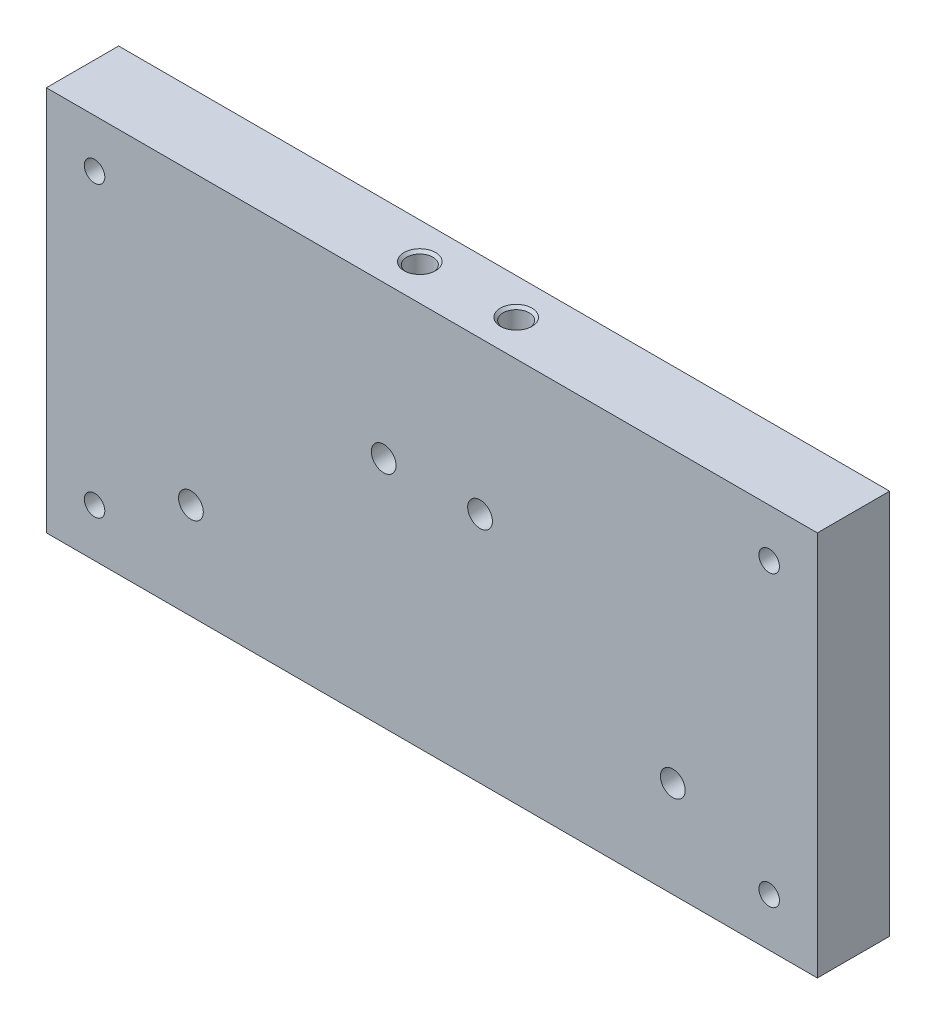
ISO-10303-21;
HEADER;
FILE_DESCRIPTION(('STEP AP214'),'2;1');
FILE_NAME('part.step','',(''),(''),'','','');
FILE_SCHEMA(('AUTOMOTIVE_DESIGN { 1 0 10303 214 1 1 1 1 }'));
ENDSEC;
DATA;
#1=APPLICATION_CONTEXT('core data for automotive mechanical design processes');
#2=APPLICATION_PROTOCOL_DEFINITION('international standard','automotive_design',2000,#1);
#3=PRODUCT_CONTEXT('',#1,'mechanical');
#4=PRODUCT('Part','Part','',(#3));
#5=PRODUCT_RELATED_PRODUCT_CATEGORY('part','',(#4));
#6=PRODUCT_DEFINITION_FORMATION('','',#4);
#7=PRODUCT_DEFINITION_CONTEXT('part definition',#1,'design');
#8=PRODUCT_DEFINITION('design','',#6,#7);
#9=PRODUCT_DEFINITION_SHAPE('','',#8);
#10=(LENGTH_UNIT() NAMED_UNIT(*) SI_UNIT(.MILLI.,.METRE.));
#11=(NAMED_UNIT(*) PLANE_ANGLE_UNIT() SI_UNIT($,.RADIAN.));
#12=(NAMED_UNIT(*) SI_UNIT($,.STERADIAN.) SOLID_ANGLE_UNIT());
#13=UNCERTAINTY_MEASURE_WITH_UNIT(LENGTH_MEASURE(1.E-05),#10,'distance_accuracy_value','');
#14=(GEOMETRIC_REPRESENTATION_CONTEXT(3) GLOBAL_UNCERTAINTY_ASSIGNED_CONTEXT((#13)) GLOBAL_UNIT_ASSIGNED_CONTEXT((#10,
#11,#12)) REPRESENTATION_CONTEXT('',''));
#15=CARTESIAN_POINT('',(0.,0.,0.));
#16=DIRECTION('',(0.,0.,1.));
#17=DIRECTION('',(1.,0.,0.));
#18=AXIS2_PLACEMENT_3D('',#15,#16,#17);
#19=CARTESIAN_POINT('',(-44.45,31.75,4.7625));
#20=DIRECTION('',(0.,1.,0.));
#21=DIRECTION('',(0.,0.,1.));
#22=AXIS2_PLACEMENT_3D('',#19,#20,#21);
#23=CONICAL_SURFACE('',#22,1.7272,1.02974425867665);
#24=CARTESIAN_POINT('',(-44.45,31.75,4.7625));
#25=DIRECTION('',(0.,1.,0.));
#26=DIRECTION('',(0.,0.,1.));
#27=AXIS2_PLACEMENT_3D('',#24,#25,#26);
#28=CIRCLE('',#27,1.7272);
#29=CARTESIAN_POINT('',(-45.7094516868955,31.75,3.58055190961019));
#30=VERTEX_POINT('',#29);
#31=CARTESIAN_POINT('',(-45.7094516868955,31.75,5.9444480903898));
#32=VERTEX_POINT('',#31);
#33=EDGE_CURVE('E118',#30,#32,#28,.T.);
#34=ORIENTED_EDGE('',*,*,#33,.T.);
#35=CARTESIAN_POINT('',(-45.616011579744,31.8539806461184,6.26295923378334));
#36=CARTESIAN_POINT('',(-45.6424570450371,31.8269669654984,6.18537432550865));
#37=CARTESIAN_POINT('',(-45.6663991134377,31.8006455714118,6.10669294519788));
#38=CARTESIAN_POINT('',(-45.7096233368764,31.7503246925266,5.94723039181544));
#39=CARTESIAN_POINT('',(-45.7289002407733,31.7263278422969,5.86644696485549));
#40=CARTESIAN_POINT('',(-45.7630504777691,31.6817010112174,5.70320454241134));
#41=CARTESIAN_POINT('',(-45.7779321701815,31.6610646729566,5.62074905059366));
#42=CARTESIAN_POINT('',(-45.8034684912397,31.6242720820129,5.45420867147322));
#43=CARTESIAN_POINT('',(-45.8141245000215,31.6081143671023,5.37012432559106));
#44=CARTESIAN_POINT('',(-45.830833970879,31.5821284895861,5.20474289893614));
#45=CARTESIAN_POINT('',(-45.8370860561425,31.57203072987,5.12350912484162));
#46=CARTESIAN_POINT('',(-45.8457783440632,31.5578501000965,4.96031459335005));
#47=CARTESIAN_POINT('',(-45.8482192357415,31.5537661428187,4.87835397005438));
#48=CARTESIAN_POINT('',(-45.8492718385232,31.5520152667129,4.7143441845942));
#49=CARTESIAN_POINT('',(-45.8478838775211,31.5543477983909,4.63229503061276));
#50=CARTESIAN_POINT('',(-45.8412910646571,31.565193063211,4.46876263607397));
#51=CARTESIAN_POINT('',(-45.836085643314,31.5737067184387,4.38727948178229));
#52=CARTESIAN_POINT('',(-45.8210386646976,31.5974805639097,4.21578962104832));
#53=CARTESIAN_POINT('',(-45.8107196394607,31.613422309852,4.12592083902801));
#54=CARTESIAN_POINT('',(-45.7853132267048,31.6506522389168,3.94796061106254));
#55=CARTESIAN_POINT('',(-45.7702230996727,31.6719434922208,3.85987021724002));
#56=CARTESIAN_POINT('',(-45.7350628735687,31.7185382482151,3.68540089927863));
#57=CARTESIAN_POINT('',(-45.7149740724879,31.7438566868548,3.59902974880056));
#58=CARTESIAN_POINT('',(-45.6809023810317,31.7838495034158,3.47125218362565));
#59=CARTESIAN_POINT('',(-45.6688988619049,31.7975056727167,3.428986189022));
#60=CARTESIAN_POINT('',(-45.6435092646849,31.8253650284051,3.34505547825473));
#61=CARTESIAN_POINT('',(-45.6301232224234,31.8395682006095,3.30339074653975));
#62=CARTESIAN_POINT('',(-45.616011579744,31.8539806461184,3.26204076621666));
#63=B_SPLINE_CURVE_WITH_KNOTS('',3,(#35,#36,#37,#38,#39,#40,#41,#42,#43,#44,#45,#46,#47,#48,#49,
#50,#51,#52,#53,#54,#55,#56,#57,#58,#59,#60,#61,#62),.UNSPECIFIED.,.F.,.F.,(4,2,2,2,2,2,2,2,2,2,
2,2,2,4),(0.,0.258873179804806,0.518036407701557,0.776703507519732,1.03528605525533,
1.28129362561106,1.52725671540037,1.77319874210599,2.01917746541702,2.29439014219718,
2.56976113087808,2.84617830386505,2.98418691842694,3.12219195704241),.UNSPECIFIED.);
#64=EDGE_CURVE('E11',#32,#30,#63,.T.);
#65=ORIENTED_EDGE('',*,*,#64,.T.);
#66=EDGE_LOOP('',(#34,#65));
#67=FACE_BOUND('',#66,.T.);
#68=ADVANCED_FACE('F37',(#67),#23,.F.);
#69=CARTESIAN_POINT('',(-57.15,31.75,4.7625));
#70=DIRECTION('',(0.,1.,0.));
#71=DIRECTION('',(0.,0.,1.));
#72=AXIS2_PLACEMENT_3D('',#69,#70,#71);
#73=CONICAL_SURFACE('',#72,1.7272,1.02974425867665);
#74=CARTESIAN_POINT('',(-57.15,31.75,4.7625));
#75=DIRECTION('',(0.,1.,0.));
#76=DIRECTION('',(0.,0.,1.));
#77=AXIS2_PLACEMENT_3D('',#74,#75,#76);
#78=CIRCLE('',#77,1.7272);
#79=CARTESIAN_POINT('',(-58.4094516868955,31.75,3.5805519096102));
#80=VERTEX_POINT('',#79);
#81=CARTESIAN_POINT('',(-58.4094516868955,31.75,5.9444480903898));
#82=VERTEX_POINT('',#81);
#83=EDGE_CURVE('E133',#80,#82,#78,.T.);
#84=ORIENTED_EDGE('',*,*,#83,.T.);
#85=CARTESIAN_POINT('',(-58.316011579744,31.8539806461184,6.26295923378334));
#86=CARTESIAN_POINT('',(-58.3424570450371,31.8269669654984,6.18537432550865));
#87=CARTESIAN_POINT('',(-58.3663991134377,31.8006455714118,6.10669294519788));
#88=CARTESIAN_POINT('',(-58.4096233368764,31.7503246925266,5.94723039181544));
#89=CARTESIAN_POINT('',(-58.4289002407733,31.7263278422969,5.8664469648555));
#90=CARTESIAN_POINT('',(-58.4630504777691,31.6817010112174,5.70320454241135));
#91=CARTESIAN_POINT('',(-58.4779321701815,31.6610646729566,5.62074905059366));
#92=CARTESIAN_POINT('',(-58.5034684912398,31.6242720820129,5.45420867147323));
#93=CARTESIAN_POINT('',(-58.5141245000215,31.6081143671023,5.37012432559106));
#94=CARTESIAN_POINT('',(-58.530833970879,31.5821284895861,5.20474289893614));
#95=CARTESIAN_POINT('',(-58.5370860561425,31.57203072987,5.12350912484162));
#96=CARTESIAN_POINT('',(-58.5457783440632,31.5578501000965,4.96031459335006));
#97=CARTESIAN_POINT('',(-58.5482192357415,31.5537661428187,4.87835397005439));
#98=CARTESIAN_POINT('',(-58.5492718385232,31.5520152667129,4.7143441845942));
#99=CARTESIAN_POINT('',(-58.5478838775211,31.5543477983909,4.63229503061276));
#100=CARTESIAN_POINT('',(-58.5412910646571,31.565193063211,4.46876263607397));
#101=CARTESIAN_POINT('',(-58.536085643314,31.5737067184387,4.38727948178229));
#102=CARTESIAN_POINT('',(-58.5210386646976,31.5974805639097,4.21578962104832));
#103=CARTESIAN_POINT('',(-58.5107196394607,31.613422309852,4.12592083902801));
#104=CARTESIAN_POINT('',(-58.4853132267048,31.6506522389168,3.94796061106254));
#105=CARTESIAN_POINT('',(-58.4702230996727,31.6719434922208,3.85987021724003));
#106=CARTESIAN_POINT('',(-58.4350628735687,31.7185382482151,3.68540089927863));
#107=CARTESIAN_POINT('',(-58.4149740724879,31.7438566868548,3.59902974880057));
#108=CARTESIAN_POINT('',(-58.3809023810317,31.7838495034158,3.47125218362565));
#109=CARTESIAN_POINT('',(-58.3688988619049,31.7975056727167,3.428986189022));
#110=CARTESIAN_POINT('',(-58.3435092646849,31.8253650284051,3.34505547825474));
#111=CARTESIAN_POINT('',(-58.3301232224234,31.8395682006095,3.30339074653975));
#112=CARTESIAN_POINT('',(-58.316011579744,31.8539806461184,3.26204076621666));
#113=B_SPLINE_CURVE_WITH_KNOTS('',3,(#85,#86,#87,#88,#89,#90,#91,#92,#93,#94,#95,#96,#97,#98,
#99,#100,#101,#102,#103,#104,#105,#106,#107,#108,#109,#110,#111,#112),.UNSPECIFIED.,.F.,.F.,(4,
2,2,2,2,2,2,2,2,2,2,2,2,4),(0.,0.258873179804806,0.518036407701554,0.776703507519731,
1.03528605525533,1.28129362561106,1.52725671540037,1.77319874210599,2.01917746541702,
2.29439014219718,2.56976113087808,2.84617830386505,2.98418691842694,3.12219195704241),.UNSPECIFIED.);
#114=EDGE_CURVE('E111',#82,#80,#113,.T.);
#115=ORIENTED_EDGE('',*,*,#114,.T.);
#116=EDGE_LOOP('',(#84,#115));
#117=FACE_BOUND('',#116,.T.);
#118=ADVANCED_FACE('F271',(#117),#73,.F.);
#119=CARTESIAN_POINT('',(0.,0.,9.525));
#120=DIRECTION('',(-1.,0.,0.));
#121=DIRECTION('',(0.,0.,1.));
#122=AXIS2_PLACEMENT_3D('',#119,#120,#121);
#123=PLANE('',#122);
#124=DIRECTION('',(0.,1.,0.));
#125=VECTOR('',#124,1.);
#126=CARTESIAN_POINT('',(0.,0.,0.));
#127=LINE('',#126,#125);
#128=CARTESIAN_POINT('',(0.,0.,0.));
#129=VERTEX_POINT('',#128);
#130=CARTESIAN_POINT('',(0.,50.8,0.));
#131=VERTEX_POINT('',#130);
#132=EDGE_CURVE('E137',#129,#131,#127,.T.);
#133=ORIENTED_EDGE('',*,*,#132,.T.);
#134=DIRECTION('',(0.,0.,-1.));
#135=VECTOR('',#134,1.);
#136=CARTESIAN_POINT('',(0.,50.8,9.525));
#137=LINE('',#136,#135);
#138=CARTESIAN_POINT('',(0.,50.8,9.525));
#139=VERTEX_POINT('',#138);
#140=EDGE_CURVE('E164',#139,#131,#137,.T.);
#141=ORIENTED_EDGE('',*,*,#140,.F.);
#142=DIRECTION('',(0.,1.,0.));
#143=VECTOR('',#142,1.);
#144=CARTESIAN_POINT('',(0.,0.,9.525));
#145=LINE('',#144,#143);
#146=CARTESIAN_POINT('',(0.,0.,9.525));
#147=VERTEX_POINT('',#146);
#148=EDGE_CURVE('E138',#147,#139,#145,.T.);
#149=ORIENTED_EDGE('',*,*,#148,.F.);
#150=DIRECTION('',(0.,0.,-1.));
#151=VECTOR('',#150,1.);
#152=CARTESIAN_POINT('',(0.,0.,9.525));
#153=LINE('',#152,#151);
#154=EDGE_CURVE('E148',#147,#129,#153,.T.);
#155=ORIENTED_EDGE('',*,*,#154,.T.);
#156=EDGE_LOOP('',(#133,#141,#149,#155));
#157=FACE_BOUND('',#156,.T.);
#158=ADVANCED_FACE('F39',(#157),#123,.F.);
#159=CARTESIAN_POINT('',(0.,50.8,9.525));
#160=DIRECTION('',(0.,-1.,0.));
#161=DIRECTION('',(1.,0.,0.));
#162=AXIS2_PLACEMENT_3D('',#159,#160,#161);
#163=PLANE('',#162);
#164=CARTESIAN_POINT('',(-44.45,50.8,4.7625));
#165=DIRECTION('',(0.,1.,0.));
#166=DIRECTION('',(0.,0.,1.));
#167=AXIS2_PLACEMENT_3D('',#164,#165,#166);
#168=CIRCLE('',#167,2.0828);
#169=CARTESIAN_POINT('',(-44.45,50.8,6.8453));
#170=VERTEX_POINT('',#169);
#171=EDGE_CURVE('E291',#170,#170,#168,.T.);
#172=ORIENTED_EDGE('',*,*,#171,.F.);
#173=EDGE_LOOP('',(#172));
#174=FACE_BOUND('',#173,.T.);
#175=CARTESIAN_POINT('',(-57.15,50.8,4.7625));
#176=DIRECTION('',(0.,1.,0.));
#177=DIRECTION('',(0.,0.,1.));
#178=AXIS2_PLACEMENT_3D('',#175,#176,#177);
#179=CIRCLE('',#178,2.0828);
#180=CARTESIAN_POINT('',(-57.15,50.8,6.8453));
#181=VERTEX_POINT('',#180);
#182=EDGE_CURVE('E122',#181,#181,#179,.T.);
#183=ORIENTED_EDGE('',*,*,#182,.F.);
#184=EDGE_LOOP('',(#183));
#185=FACE_BOUND('',#184,.T.);
#186=DIRECTION('',(-1.,0.,0.));
#187=VECTOR('',#186,1.);
#188=CARTESIAN_POINT('',(0.,50.8,0.));
#189=LINE('',#188,#187);
#190=CARTESIAN_POINT('',(-101.6,50.8,0.));
#191=VERTEX_POINT('',#190);
#192=EDGE_CURVE('E151',#131,#191,#189,.T.);
#193=ORIENTED_EDGE('',*,*,#192,.T.);
#194=DIRECTION('',(0.,0.,-1.));
#195=VECTOR('',#194,1.);
#196=CARTESIAN_POINT('',(-101.6,50.8,9.525));
#197=LINE('',#196,#195);
#198=CARTESIAN_POINT('',(-101.6,50.8,9.525));
#199=VERTEX_POINT('',#198);
#200=EDGE_CURVE('E161',#199,#191,#197,.T.);
#201=ORIENTED_EDGE('',*,*,#200,.F.);
#202=DIRECTION('',(-1.,0.,0.));
#203=VECTOR('',#202,1.);
#204=CARTESIAN_POINT('',(0.,50.8,9.525));
#205=LINE('',#204,#203);
#206=EDGE_CURVE('E141',#139,#199,#205,.T.);
#207=ORIENTED_EDGE('',*,*,#206,.F.);
#208=ORIENTED_EDGE('',*,*,#140,.T.);
#209=EDGE_LOOP('',(#193,#201,#207,#208));
#210=FACE_BOUND('',#209,.T.);
#211=ADVANCED_FACE('F255',(#174,#185,#210),#163,.F.);
#212=CARTESIAN_POINT('',(-101.6,0.,9.525));
#213=DIRECTION('',(1.,0.,0.));
#214=DIRECTION('',(0.,0.,-1.));
#215=AXIS2_PLACEMENT_3D('',#212,#213,#214);
#216=PLANE('',#215);
#217=DIRECTION('',(0.,-1.,0.));
#218=VECTOR('',#217,1.);
#219=CARTESIAN_POINT('',(-101.6,0.,0.));
#220=LINE('',#219,#218);
#221=CARTESIAN_POINT('',(-101.6,0.,0.));
#222=VERTEX_POINT('',#221);
#223=EDGE_CURVE('E153',#191,#222,#220,.T.);
#224=ORIENTED_EDGE('',*,*,#223,.T.);
#225=DIRECTION('',(0.,0.,-1.));
#226=VECTOR('',#225,1.);
#227=CARTESIAN_POINT('',(-101.6,0.,9.525));
#228=LINE('',#227,#226);
#229=CARTESIAN_POINT('',(-101.6,0.,9.525));
#230=VERTEX_POINT('',#229);
#231=EDGE_CURVE('E158',#230,#222,#228,.T.);
#232=ORIENTED_EDGE('',*,*,#231,.F.);
#233=DIRECTION('',(0.,-1.,0.));
#234=VECTOR('',#233,1.);
#235=CARTESIAN_POINT('',(-101.6,0.,9.525));
#236=LINE('',#235,#234);
#237=EDGE_CURVE('E144',#199,#230,#236,.T.);
#238=ORIENTED_EDGE('',*,*,#237,.F.);
#239=ORIENTED_EDGE('',*,*,#200,.T.);
#240=EDGE_LOOP('',(#224,#232,#238,#239));
#241=FACE_BOUND('',#240,.T.);
#242=ADVANCED_FACE('F260',(#241),#216,.F.);
#243=CARTESIAN_POINT('',(0.,0.,9.525));
#244=DIRECTION('',(0.,1.,0.));
#245=DIRECTION('',(-1.,0.,0.));
#246=AXIS2_PLACEMENT_3D('',#243,#244,#245);
#247=PLANE('',#246);
#248=DIRECTION('',(1.,0.,0.));
#249=VECTOR('',#248,1.);
#250=CARTESIAN_POINT('',(0.,0.,0.));
#251=LINE('',#250,#249);
#252=EDGE_CURVE('E142',#222,#129,#251,.T.);
#253=ORIENTED_EDGE('',*,*,#252,.T.);
#254=ORIENTED_EDGE('',*,*,#154,.F.);
#255=DIRECTION('',(1.,0.,0.));
#256=VECTOR('',#255,1.);
#257=CARTESIAN_POINT('',(0.,0.,9.525));
#258=LINE('',#257,#256);
#259=EDGE_CURVE('E146',#230,#147,#258,.T.);
#260=ORIENTED_EDGE('',*,*,#259,.F.);
#261=ORIENTED_EDGE('',*,*,#231,.T.);
#262=EDGE_LOOP('',(#253,#254,#260,#261));
#263=FACE_BOUND('',#262,.T.);
#264=ADVANCED_FACE('F245',(#263),#247,.F.);
#265=CARTESIAN_POINT('',(0.,0.,9.525));
#266=DIRECTION('',(0.,0.,1.));
#267=DIRECTION('',(1.,0.,0.));
#268=AXIS2_PLACEMENT_3D('',#265,#266,#267);
#269=PLANE('',#268);
#270=CARTESIAN_POINT('',(-82.55,12.7,9.525));
#271=DIRECTION('',(0.,0.,1.));
#272=DIRECTION('',(1.,0.,0.));
#273=AXIS2_PLACEMENT_3D('',#270,#271,#272);
#274=CIRCLE('',#273,1.63194999999999);
#275=CARTESIAN_POINT('',(-80.91805,12.7,9.525));
#276=VERTEX_POINT('',#275);
#277=EDGE_CURVE('E484',#276,#276,#274,.T.);
#278=ORIENTED_EDGE('',*,*,#277,.F.);
#279=EDGE_LOOP('',(#278));
#280=FACE_BOUND('',#279,.T.);
#281=CARTESIAN_POINT('',(-19.05,12.7,9.525));
#282=DIRECTION('',(0.,0.,1.));
#283=DIRECTION('',(1.,0.,0.));
#284=AXIS2_PLACEMENT_3D('',#281,#282,#283);
#285=CIRCLE('',#284,1.63195);
#286=CARTESIAN_POINT('',(-17.41805,12.7,9.525));
#287=VERTEX_POINT('',#286);
#288=EDGE_CURVE('E486',#287,#287,#285,.T.);
#289=ORIENTED_EDGE('',*,*,#288,.F.);
#290=EDGE_LOOP('',(#289));
#291=FACE_BOUND('',#290,.T.);
#292=CARTESIAN_POINT('',(-95.25,6.34999999999999,9.525));
#293=DIRECTION('',(0.,0.,1.));
#294=DIRECTION('',(1.,0.,0.));
#295=AXIS2_PLACEMENT_3D('',#292,#293,#294);
#296=CIRCLE('',#295,1.35254999999998);
#297=CARTESIAN_POINT('',(-93.89745,6.34999999999999,9.525));
#298=VERTEX_POINT('',#297);
#299=EDGE_CURVE('E494',#298,#298,#296,.T.);
#300=ORIENTED_EDGE('',*,*,#299,.F.);
#301=EDGE_LOOP('',(#300));
#302=FACE_BOUND('',#301,.T.);
#303=CARTESIAN_POINT('',(-95.25,44.45,9.525));
#304=DIRECTION('',(0.,0.,1.));
#305=DIRECTION('',(1.,0.,0.));
#306=AXIS2_PLACEMENT_3D('',#303,#304,#305);
#307=CIRCLE('',#306,1.35254999999998);
#308=CARTESIAN_POINT('',(-93.89745,44.45,9.525));
#309=VERTEX_POINT('',#308);
#310=EDGE_CURVE('E500',#309,#309,#307,.T.);
#311=ORIENTED_EDGE('',*,*,#310,.F.);
#312=EDGE_LOOP('',(#311));
#313=FACE_BOUND('',#312,.T.);
#314=CARTESIAN_POINT('',(-6.35,6.35,9.525));
#315=DIRECTION('',(0.,0.,1.));
#316=DIRECTION('',(1.,0.,0.));
#317=AXIS2_PLACEMENT_3D('',#314,#315,#316);
#318=CIRCLE('',#317,1.35254999999999);
#319=CARTESIAN_POINT('',(-4.99745000000001,6.35,9.525));
#320=VERTEX_POINT('',#319);
#321=EDGE_CURVE('E506',#320,#320,#318,.T.);
#322=ORIENTED_EDGE('',*,*,#321,.F.);
#323=EDGE_LOOP('',(#322));
#324=FACE_BOUND('',#323,.T.);
#325=CARTESIAN_POINT('',(-6.35,44.45,9.525));
#326=DIRECTION('',(0.,0.,1.));
#327=DIRECTION('',(1.,0.,0.));
#328=AXIS2_PLACEMENT_3D('',#325,#326,#327);
#329=CIRCLE('',#328,1.35254999999999);
#330=CARTESIAN_POINT('',(-4.99745000000001,44.45,9.525));
#331=VERTEX_POINT('',#330);
#332=EDGE_CURVE('E512',#331,#331,#329,.T.);
#333=ORIENTED_EDGE('',*,*,#332,.F.);
#334=EDGE_LOOP('',(#333));
#335=FACE_BOUND('',#334,.T.);
#336=CARTESIAN_POINT('',(-44.45,30.7121935388156,9.525));
#337=DIRECTION('',(0.,0.,1.));
#338=DIRECTION('',(1.,0.,0.));
#339=AXIS2_PLACEMENT_3D('',#336,#337,#338);
#340=CIRCLE('',#339,1.63195);
#341=CARTESIAN_POINT('',(-42.81805,30.7121935388156,9.525));
#342=VERTEX_POINT('',#341);
#343=EDGE_CURVE('E119',#342,#342,#340,.T.);
#344=ORIENTED_EDGE('',*,*,#343,.F.);
#345=EDGE_LOOP('',(#344));
#346=FACE_BOUND('',#345,.T.);
#347=CARTESIAN_POINT('',(-57.15,30.7121935388156,9.525));
#348=DIRECTION('',(0.,0.,1.));
#349=DIRECTION('',(1.,0.,0.));
#350=AXIS2_PLACEMENT_3D('',#347,#348,#349);
#351=CIRCLE('',#350,1.63195);
#352=CARTESIAN_POINT('',(-55.51805,30.7121935388156,9.525));
#353=VERTEX_POINT('',#352);
#354=EDGE_CURVE('E200',#353,#353,#351,.T.);
#355=ORIENTED_EDGE('',*,*,#354,.F.);
#356=EDGE_LOOP('',(#355));
#357=FACE_BOUND('',#356,.T.);
#358=ORIENTED_EDGE('',*,*,#148,.T.);
#359=ORIENTED_EDGE('',*,*,#206,.T.);
#360=ORIENTED_EDGE('',*,*,#237,.T.);
#361=ORIENTED_EDGE('',*,*,#259,.T.);
#362=EDGE_LOOP('',(#358,#359,#360,#361));
#363=FACE_BOUND('',#362,.T.);
#364=ADVANCED_FACE('F241',(#280,#291,#302,#313,#324,#335,#346,#357,#363),#269,.T.);
#365=CARTESIAN_POINT('',(0.,0.,0.));
#366=DIRECTION('',(0.,0.,1.));
#367=DIRECTION('',(1.,0.,0.));
#368=AXIS2_PLACEMENT_3D('',#365,#366,#367);
#369=PLANE('',#368);
#370=CARTESIAN_POINT('',(-82.55,12.7,0.));
#371=DIRECTION('',(0.,0.,1.));
#372=DIRECTION('',(1.,0.,0.));
#373=AXIS2_PLACEMENT_3D('',#370,#371,#372);
#374=CIRCLE('',#373,1.63194999999999);
#375=CARTESIAN_POINT('',(-80.91805,12.7,0.));
#376=VERTEX_POINT('',#375);
#377=EDGE_CURVE('E481',#376,#376,#374,.T.);
#378=ORIENTED_EDGE('',*,*,#377,.T.);
#379=EDGE_LOOP('',(#378));
#380=FACE_BOUND('',#379,.T.);
#381=CARTESIAN_POINT('',(-19.05,12.7,0.));
#382=DIRECTION('',(0.,0.,1.));
#383=DIRECTION('',(1.,0.,0.));
#384=AXIS2_PLACEMENT_3D('',#381,#382,#383);
#385=CIRCLE('',#384,1.63195);
#386=CARTESIAN_POINT('',(-17.41805,12.7,0.));
#387=VERTEX_POINT('',#386);
#388=EDGE_CURVE('E491',#387,#387,#385,.T.);
#389=ORIENTED_EDGE('',*,*,#388,.T.);
#390=EDGE_LOOP('',(#389));
#391=FACE_BOUND('',#390,.T.);
#392=CARTESIAN_POINT('',(-95.25,6.34999999999999,0.));
#393=DIRECTION('',(0.,0.,1.));
#394=DIRECTION('',(1.,0.,0.));
#395=AXIS2_PLACEMENT_3D('',#392,#393,#394);
#396=CIRCLE('',#395,1.35254999999999);
#397=CARTESIAN_POINT('',(-93.89745,6.34999999999999,0.));
#398=VERTEX_POINT('',#397);
#399=EDGE_CURVE('E497',#398,#398,#396,.T.);
#400=ORIENTED_EDGE('',*,*,#399,.T.);
#401=EDGE_LOOP('',(#400));
#402=FACE_BOUND('',#401,.T.);
#403=CARTESIAN_POINT('',(-95.25,44.45,0.));
#404=DIRECTION('',(0.,0.,1.));
#405=DIRECTION('',(1.,0.,0.));
#406=AXIS2_PLACEMENT_3D('',#403,#404,#405);
#407=CIRCLE('',#406,1.35254999999999);
#408=CARTESIAN_POINT('',(-93.89745,44.45,0.));
#409=VERTEX_POINT('',#408);
#410=EDGE_CURVE('E503',#409,#409,#407,.T.);
#411=ORIENTED_EDGE('',*,*,#410,.T.);
#412=EDGE_LOOP('',(#411));
#413=FACE_BOUND('',#412,.T.);
#414=CARTESIAN_POINT('',(-6.35,6.35,0.));
#415=DIRECTION('',(0.,0.,1.));
#416=DIRECTION('',(1.,0.,0.));
#417=AXIS2_PLACEMENT_3D('',#414,#415,#416);
#418=CIRCLE('',#417,1.35255);
#419=CARTESIAN_POINT('',(-4.99745,6.35,0.));
#420=VERTEX_POINT('',#419);
#421=EDGE_CURVE('E509',#420,#420,#418,.T.);
#422=ORIENTED_EDGE('',*,*,#421,.T.);
#423=EDGE_LOOP('',(#422));
#424=FACE_BOUND('',#423,.T.);
#425=CARTESIAN_POINT('',(-6.35,44.45,0.));
#426=DIRECTION('',(0.,0.,1.));
#427=DIRECTION('',(1.,0.,0.));
#428=AXIS2_PLACEMENT_3D('',#425,#426,#427);
#429=CIRCLE('',#428,1.35255);
#430=CARTESIAN_POINT('',(-4.99745,44.45,0.));
#431=VERTEX_POINT('',#430);
#432=EDGE_CURVE('E515',#431,#431,#429,.T.);
#433=ORIENTED_EDGE('',*,*,#432,.T.);
#434=EDGE_LOOP('',(#433));
#435=FACE_BOUND('',#434,.T.);
#436=CARTESIAN_POINT('',(-44.45,30.7121935388156,0.));
#437=DIRECTION('',(0.,0.,1.));
#438=DIRECTION('',(1.,0.,0.));
#439=AXIS2_PLACEMENT_3D('',#436,#437,#438);
#440=CIRCLE('',#439,1.63195);
#441=CARTESIAN_POINT('',(-42.81805,30.7121935388156,0.));
#442=VERTEX_POINT('',#441);
#443=EDGE_CURVE('E232',#442,#442,#440,.T.);
#444=ORIENTED_EDGE('',*,*,#443,.T.);
#445=EDGE_LOOP('',(#444));
#446=FACE_BOUND('',#445,.T.);
#447=CARTESIAN_POINT('',(-57.15,30.7121935388156,0.));
#448=DIRECTION('',(0.,0.,1.));
#449=DIRECTION('',(1.,0.,0.));
#450=AXIS2_PLACEMENT_3D('',#447,#448,#449);
#451=CIRCLE('',#450,1.63195);
#452=CARTESIAN_POINT('',(-55.51805,30.7121935388156,0.));
#453=VERTEX_POINT('',#452);
#454=EDGE_CURVE('E289',#453,#453,#451,.T.);
#455=ORIENTED_EDGE('',*,*,#454,.T.);
#456=EDGE_LOOP('',(#455));
#457=FACE_BOUND('',#456,.T.);
#458=ORIENTED_EDGE('',*,*,#132,.F.);
#459=ORIENTED_EDGE('',*,*,#252,.F.);
#460=ORIENTED_EDGE('',*,*,#223,.F.);
#461=ORIENTED_EDGE('',*,*,#192,.F.);
#462=EDGE_LOOP('',(#458,#459,#460,#461));
#463=FACE_BOUND('',#462,.T.);
#464=ADVANCED_FACE('F244',(#380,#391,#402,#413,#424,#435,#446,#457,#463),#369,.F.);
#465=CARTESIAN_POINT('',(-55.8905483131045,31.75,5.94444809038982));
#466=VERTEX_POINT('',#465);
#467=CARTESIAN_POINT('',(-55.8905483131045,31.75,3.58055190961018));
#468=VERTEX_POINT('',#467);
#469=EDGE_CURVE('E134',#466,#468,#78,.T.);
#470=ORIENTED_EDGE('',*,*,#469,.T.);
#471=CARTESIAN_POINT('',(-55.9839884202561,31.8539806461184,3.26204076621665));
#472=CARTESIAN_POINT('',(-55.957542954963,31.8269669654984,3.33962567449134));
#473=CARTESIAN_POINT('',(-55.9336008865623,31.8006455714118,3.41830705480211));
#474=CARTESIAN_POINT('',(-55.8903766631236,31.7503246925266,3.57776960818455));
#475=CARTESIAN_POINT('',(-55.8710997592267,31.7263278422969,3.65855303514449));
#476=CARTESIAN_POINT('',(-55.836949522231,31.6817010112174,3.82179545758864));
#477=CARTESIAN_POINT('',(-55.8220678298186,31.6610646729566,3.90425094940633));
#478=CARTESIAN_POINT('',(-55.7965315087603,31.6242720820129,4.07079132852676));
#479=CARTESIAN_POINT('',(-55.7858754999785,31.6081143671023,4.15487567440892));
#480=CARTESIAN_POINT('',(-55.769166029121,31.5821284895861,4.32025710106384));
#481=CARTESIAN_POINT('',(-55.7629139438575,31.57203072987,4.40149087515836));
#482=CARTESIAN_POINT('',(-55.7542216559368,31.5578501000965,4.56468540664993));
#483=CARTESIAN_POINT('',(-55.7517807642586,31.5537661428187,4.6466460299456));
#484=CARTESIAN_POINT('',(-55.7507281614769,31.5520152667129,4.81065581540578));
#485=CARTESIAN_POINT('',(-55.7521161224789,31.5543477983909,4.89270496938722));
#486=CARTESIAN_POINT('',(-55.758708935343,31.565193063211,5.05623736392601));
#487=CARTESIAN_POINT('',(-55.763914356686,31.5737067184387,5.13772051821769));
#488=CARTESIAN_POINT('',(-55.7789613353024,31.5974805639097,5.30921037895166));
#489=CARTESIAN_POINT('',(-55.7892803605394,31.613422309852,5.39907916097197));
#490=CARTESIAN_POINT('',(-55.8146867732952,31.6506522389168,5.57703938893745));
#491=CARTESIAN_POINT('',(-55.8297769003274,31.6719434922208,5.66512978275997));
#492=CARTESIAN_POINT('',(-55.8649371264313,31.7185382482151,5.83959910072137));
#493=CARTESIAN_POINT('',(-55.8850259275121,31.7438566868548,5.92597025119943));
#494=CARTESIAN_POINT('',(-55.9190976189683,31.7838495034158,6.05374781637435));
#495=CARTESIAN_POINT('',(-55.9311011380951,31.7975056727167,6.09601381097801));
#496=CARTESIAN_POINT('',(-55.9564907353151,31.8253650284051,6.17994452174527));
#497=CARTESIAN_POINT('',(-55.9698767775767,31.8395682006095,6.22160925346026));
#498=CARTESIAN_POINT('',(-55.9839884202561,31.8539806461184,6.26295923378335));
#499=B_SPLINE_CURVE_WITH_KNOTS('',3,(#471,#472,#473,#474,#475,#476,#477,#478,#479,#480,#481,
#482,#483,#484,#485,#486,#487,#488,#489,#490,#491,#492,#493,#494,#495,#496,#497,#498),
.UNSPECIFIED.,.F.,.F.,(4,2,2,2,2,2,2,2,2,2,2,2,2,4),(0.,0.258873179804805,0.518036407701557,
0.77670350751973,1.03528605525532,1.28129362561105,1.52725671540036,1.77319874210598,
2.01917746541701,2.29439014219718,2.56976113087808,2.84617830386507,2.98418691842695,
3.12219195704243),.UNSPECIFIED.);
#500=EDGE_CURVE('E167',#468,#466,#499,.T.);
#501=ORIENTED_EDGE('',*,*,#500,.T.);
#502=EDGE_LOOP('',(#470,#501));
#503=FACE_BOUND('',#502,.T.);
#504=ADVANCED_FACE('F177',(#503),#73,.F.);
#505=CARTESIAN_POINT('',(-57.15,50.8,4.7625));
#506=DIRECTION('',(0.,1.,0.));
#507=DIRECTION('',(0.,0.,1.));
#508=AXIS2_PLACEMENT_3D('',#505,#506,#507);
#509=CYLINDRICAL_SURFACE('',#508,1.7272);
#510=ORIENTED_EDGE('',*,*,#469,.F.);
#511=CARTESIAN_POINT('',(-55.8905483131045,31.75,5.94444809038982));
#512=CARTESIAN_POINT('',(-55.9448393727595,31.8158265031881,6.00233674820044));
#513=CARTESIAN_POINT('',(-56.0052858116749,31.8786919602597,6.0586985097822));
#514=CARTESIAN_POINT('',(-56.1391698821798,31.9965467318205,6.16565485331216));
#515=CARTESIAN_POINT('',(-56.2127272429796,32.0514541926305,6.21618853741466));
#516=CARTESIAN_POINT('',(-56.3538083607953,32.1385500598279,6.29686186028715));
#517=CARTESIAN_POINT('',(-56.4187267978939,32.1730493092362,6.32900788424474));
#518=CARTESIAN_POINT('',(-56.5552128796986,32.2337205934779,6.38573246540503));
#519=CARTESIAN_POINT('',(-56.6267583138493,32.2599192298614,6.41033518879081));
#520=CARTESIAN_POINT('',(-56.7760171810649,32.3026252352012,6.45051072431068));
#521=CARTESIAN_POINT('',(-56.8537856367085,32.3190319975894,6.46598977591868));
#522=CARTESIAN_POINT('',(-57.0122998296572,32.3402834259655,6.48604940609793));
#523=CARTESIAN_POINT('',(-57.0930445180151,32.3451321266644,6.49063378780044));
#524=CARTESIAN_POINT('',(-57.2426402830759,32.3429793597183,6.48860026567499));
#525=CARTESIAN_POINT('',(-57.3115441827976,32.3375703331336,6.48348772381796));
#526=CARTESIAN_POINT('',(-57.4470632318055,32.3183368898573,6.46533449701243));
#527=CARTESIAN_POINT('',(-57.5136786991132,32.3045136475206,6.45229491842453));
#528=CARTESIAN_POINT('',(-57.6426415177571,32.2694383160538,6.41928469633699));
#529=CARTESIAN_POINT('',(-57.7050110165594,32.248228984885,6.39935395035733));
#530=CARTESIAN_POINT('',(-57.8249402964561,32.1994448788519,6.35366388435101));
#531=CARTESIAN_POINT('',(-57.8824957502268,32.1718644590504,6.32789939589204));
#532=CARTESIAN_POINT('',(-58.0187521815306,32.096808245608,6.25810816954318));
#533=CARTESIAN_POINT('',(-58.0942624540608,32.0461526859425,6.21126690822206));
#534=CARTESIAN_POINT('',(-58.2331272384041,31.9361112989755,6.11061893325904));
#535=CARTESIAN_POINT('',(-58.2964764231842,31.876721665833,6.05680918435071));
#536=CARTESIAN_POINT('',(-58.3730942210857,31.7929792328712,5.98232513844938));
#537=CARTESIAN_POINT('',(-58.3915962399643,31.7716619449113,5.96347424224015));
#538=CARTESIAN_POINT('',(-58.4094516868955,31.75,5.9444480903898));
#539=B_SPLINE_CURVE_WITH_KNOTS('',3,(#511,#512,#513,#514,#515,#516,#517,#518,#519,#520,#521,
#522,#523,#524,#525,#526,#527,#528,#529,#530,#531,#532,#533,#534,#535,#536,#537,#538),
.UNSPECIFIED.,.F.,.F.,(4,2,2,2,2,2,2,2,2,2,2,2,2,4),(0.,0.309891109950307,0.622772488920289,
0.862555711040069,1.1015625227324,1.34298452493932,1.58432223872581,1.79121742819298,
1.99808374834134,2.20377190073595,2.4096430015619,2.71481188906255,3.02011414898488,
3.12189534328937),.UNSPECIFIED.);
#540=EDGE_CURVE('E65',#466,#82,#539,.T.);
#541=ORIENTED_EDGE('',*,*,#540,.T.);
#542=ORIENTED_EDGE('',*,*,#83,.F.);
#543=CARTESIAN_POINT('',(-58.4094516868955,31.75,3.5805519096102));
#544=CARTESIAN_POINT('',(-58.3551606272405,31.8158265031881,3.52266325179958));
#545=CARTESIAN_POINT('',(-58.2947141883251,31.8786919602597,3.46630149021781));
#546=CARTESIAN_POINT('',(-58.1608301178202,31.9965467318205,3.35934514668785));
#547=CARTESIAN_POINT('',(-58.0872727570204,32.0514541926305,3.30881146258535));
#548=CARTESIAN_POINT('',(-57.9461916392047,32.1385500598279,3.22813813971285));
#549=CARTESIAN_POINT('',(-57.8812732021062,32.1730493092362,3.19599211575526));
#550=CARTESIAN_POINT('',(-57.7447871203014,32.2337205934779,3.13926753459497));
#551=CARTESIAN_POINT('',(-57.6732416861508,32.2599192298614,3.1146648112092));
#552=CARTESIAN_POINT('',(-57.5239828189351,32.3026252352012,3.07448927568932));
#553=CARTESIAN_POINT('',(-57.4462143632915,32.3190319975894,3.05901022408133));
#554=CARTESIAN_POINT('',(-57.2877001703428,32.3402834259655,3.03895059390207));
#555=CARTESIAN_POINT('',(-57.2069554819849,32.3451321266644,3.03436621219956));
#556=CARTESIAN_POINT('',(-57.0573597169241,32.3429793597183,3.03639973432501));
#557=CARTESIAN_POINT('',(-56.9884558172024,32.3375703331336,3.04151227618204));
#558=CARTESIAN_POINT('',(-56.8529367681945,32.3183368898573,3.05966550298757));
#559=CARTESIAN_POINT('',(-56.7863213008868,32.3045136475206,3.07270508157546));
#560=CARTESIAN_POINT('',(-56.6573584822429,32.2694383160538,3.10571530366301));
#561=CARTESIAN_POINT('',(-56.5949889834406,32.248228984885,3.12564604964267));
#562=CARTESIAN_POINT('',(-56.4750597035439,32.1994448788519,3.17133611564899));
#563=CARTESIAN_POINT('',(-56.4175042497732,32.1718644590504,3.19710060410796));
#564=CARTESIAN_POINT('',(-56.2812478184694,32.096808245608,3.26689183045682));
#565=CARTESIAN_POINT('',(-56.2057375459392,32.0461526859425,3.31373309177794));
#566=CARTESIAN_POINT('',(-56.0668727615959,31.9361112989755,3.41438106674096));
#567=CARTESIAN_POINT('',(-56.0035235768158,31.876721665833,3.46819081564929));
#568=CARTESIAN_POINT('',(-55.9269057789144,31.7929792328712,3.54267486155062));
#569=CARTESIAN_POINT('',(-55.9084037600357,31.7716619449113,3.56152575775984));
#570=CARTESIAN_POINT('',(-55.8905483131045,31.75,3.58055190961018));
#571=B_SPLINE_CURVE_WITH_KNOTS('',3,(#543,#544,#545,#546,#547,#548,#549,#550,#551,#552,#553,
#554,#555,#556,#557,#558,#559,#560,#561,#562,#563,#564,#565,#566,#567,#568,#569,#570),
.UNSPECIFIED.,.F.,.F.,(4,2,2,2,2,2,2,2,2,2,2,2,2,4),(0.,0.309891109950309,0.622772488920298,
0.862555711040073,1.10156252273241,1.34298452493932,1.58432223872583,1.79121742819299,
1.99808374834135,2.20377190073597,2.40964300156192,2.71481188906258,3.0201141489849,
3.12189534328937),.UNSPECIFIED.);
#572=EDGE_CURVE('E194',#80,#468,#571,.T.);
#573=ORIENTED_EDGE('',*,*,#572,.T.);
#574=EDGE_LOOP('',(#510,#541,#542,#573));
#575=FACE_BOUND('',#574,.T.);
#576=CARTESIAN_POINT('',(-57.15,50.4444,4.7625));
#577=DIRECTION('',(0.,1.,0.));
#578=DIRECTION('',(0.,0.,1.));
#579=AXIS2_PLACEMENT_3D('',#576,#577,#578);
#580=CIRCLE('',#579,1.7272);
#581=CARTESIAN_POINT('',(-57.15,50.4444,6.4897));
#582=VERTEX_POINT('',#581);
#583=EDGE_CURVE('E125',#582,#582,#580,.T.);
#584=ORIENTED_EDGE('',*,*,#583,.T.);
#585=EDGE_LOOP('',(#584));
#586=FACE_BOUND('',#585,.T.);
#587=ADVANCED_FACE('F206',(#575,#586),#509,.F.);
#588=CARTESIAN_POINT('',(-57.15,50.8,4.7625));
#589=DIRECTION('',(0.,1.,0.));
#590=DIRECTION('',(0.,0.,1.));
#591=AXIS2_PLACEMENT_3D('',#588,#589,#590);
#592=CONICAL_SURFACE('',#591,2.0828,0.785398163397448);
#593=ORIENTED_EDGE('',*,*,#583,.F.);
#594=EDGE_LOOP('',(#593));
#595=FACE_BOUND('',#594,.T.);
#596=ORIENTED_EDGE('',*,*,#182,.T.);
#597=EDGE_LOOP('',(#596));
#598=FACE_BOUND('',#597,.T.);
#599=ADVANCED_FACE('F210',(#595,#598),#592,.F.);
#600=CARTESIAN_POINT('',(-43.1905483131045,31.75,5.94444809038982));
#601=VERTEX_POINT('',#600);
#602=CARTESIAN_POINT('',(-43.1905483131045,31.75,3.58055190961018));
#603=VERTEX_POINT('',#602);
#604=EDGE_CURVE('E116',#601,#603,#28,.T.);
#605=ORIENTED_EDGE('',*,*,#604,.T.);
#606=CARTESIAN_POINT('',(-43.2839884202561,31.8539806461184,3.26204076621665));
#607=CARTESIAN_POINT('',(-43.257542954963,31.8269669654984,3.33962567449133));
#608=CARTESIAN_POINT('',(-43.2336008865623,31.8006455714118,3.4183070548021));
#609=CARTESIAN_POINT('',(-43.1903766631236,31.7503246925266,3.57776960818454));
#610=CARTESIAN_POINT('',(-43.1710997592267,31.7263278422969,3.65855303514449));
#611=CARTESIAN_POINT('',(-43.136949522231,31.6817010112174,3.82179545758864));
#612=CARTESIAN_POINT('',(-43.1220678298186,31.6610646729566,3.90425094940633));
#613=CARTESIAN_POINT('',(-43.0965315087603,31.6242720820129,4.07079132852676));
#614=CARTESIAN_POINT('',(-43.0858754999785,31.6081143671023,4.15487567440892));
#615=CARTESIAN_POINT('',(-43.069166029121,31.5821284895861,4.32025710106384));
#616=CARTESIAN_POINT('',(-43.0629139438575,31.57203072987,4.40149087515836));
#617=CARTESIAN_POINT('',(-43.0542216559368,31.5578501000965,4.56468540664992));
#618=CARTESIAN_POINT('',(-43.0517807642586,31.5537661428187,4.64664602994559));
#619=CARTESIAN_POINT('',(-43.0507281614769,31.5520152667129,4.81065581540578));
#620=CARTESIAN_POINT('',(-43.0521161224789,31.5543477983909,4.89270496938721));
#621=CARTESIAN_POINT('',(-43.0587089353429,31.565193063211,5.05623736392601));
#622=CARTESIAN_POINT('',(-43.063914356686,31.5737067184387,5.13772051821768));
#623=CARTESIAN_POINT('',(-43.0789613353024,31.5974805639097,5.30921037895166));
#624=CARTESIAN_POINT('',(-43.0892803605394,31.613422309852,5.39907916097197));
#625=CARTESIAN_POINT('',(-43.1146867732952,31.6506522389168,5.57703938893744));
#626=CARTESIAN_POINT('',(-43.1297769003274,31.6719434922208,5.66512978275996));
#627=CARTESIAN_POINT('',(-43.1649371264313,31.7185382482151,5.83959910072136));
#628=CARTESIAN_POINT('',(-43.1850259275121,31.7438566868548,5.92597025119943));
#629=CARTESIAN_POINT('',(-43.2190976189683,31.7838495034158,6.05374781637435));
#630=CARTESIAN_POINT('',(-43.2311011380951,31.7975056727167,6.096013810978));
#631=CARTESIAN_POINT('',(-43.2564907353151,31.8253650284051,6.17994452174527));
#632=CARTESIAN_POINT('',(-43.2698767775767,31.8395682006095,6.22160925346025));
#633=CARTESIAN_POINT('',(-43.2839884202561,31.8539806461184,6.26295923378335));
#634=B_SPLINE_CURVE_WITH_KNOTS('',3,(#606,#607,#608,#609,#610,#611,#612,#613,#614,#615,#616,
#617,#618,#619,#620,#621,#622,#623,#624,#625,#626,#627,#628,#629,#630,#631,#632,#633),
.UNSPECIFIED.,.F.,.F.,(4,2,2,2,2,2,2,2,2,2,2,2,2,4),(0.,0.258873179804805,0.518036407701556,
0.77670350751973,1.03528605525532,1.28129362561105,1.52725671540036,1.77319874210598,
2.01917746541701,2.29439014219718,2.56976113087808,2.84617830386507,2.98418691842696,
3.12219195704243),.UNSPECIFIED.);
#635=EDGE_CURVE('E50',#603,#601,#634,.T.);
#636=ORIENTED_EDGE('',*,*,#635,.T.);
#637=EDGE_LOOP('',(#605,#636));
#638=FACE_BOUND('',#637,.T.);
#639=ADVANCED_FACE('F121',(#638),#23,.F.);
#640=CARTESIAN_POINT('',(-44.45,50.8,4.7625));
#641=DIRECTION('',(0.,1.,0.));
#642=DIRECTION('',(0.,0.,1.));
#643=AXIS2_PLACEMENT_3D('',#640,#641,#642);
#644=CYLINDRICAL_SURFACE('',#643,1.7272);
#645=ORIENTED_EDGE('',*,*,#604,.F.);
#646=CARTESIAN_POINT('',(-43.1905483131045,31.75,5.94444809038982));
#647=CARTESIAN_POINT('',(-43.2448393727595,31.8158265031881,6.00233674820043));
#648=CARTESIAN_POINT('',(-43.3052858116749,31.8786919602597,6.0586985097822));
#649=CARTESIAN_POINT('',(-43.4391698821798,31.9965467318205,6.16565485331216));
#650=CARTESIAN_POINT('',(-43.5127272429796,32.0514541926305,6.21618853741465));
#651=CARTESIAN_POINT('',(-43.6538083607953,32.1385500598279,6.29686186028715));
#652=CARTESIAN_POINT('',(-43.7187267978939,32.1730493092362,6.32900788424474));
#653=CARTESIAN_POINT('',(-43.8552128796986,32.2337205934779,6.38573246540503));
#654=CARTESIAN_POINT('',(-43.9267583138493,32.2599192298614,6.41033518879081));
#655=CARTESIAN_POINT('',(-44.0760171810649,32.3026252352012,6.45051072431067));
#656=CARTESIAN_POINT('',(-44.1537856367085,32.3190319975894,6.46598977591867));
#657=CARTESIAN_POINT('',(-44.3122998296572,32.3402834259655,6.48604940609793));
#658=CARTESIAN_POINT('',(-44.3930445180151,32.3451321266644,6.49063378780044));
#659=CARTESIAN_POINT('',(-44.5426402830759,32.3429793597183,6.48860026567499));
#660=CARTESIAN_POINT('',(-44.6115441827976,32.3375703331336,6.48348772381795));
#661=CARTESIAN_POINT('',(-44.7470632318055,32.3183368898573,6.46533449701243));
#662=CARTESIAN_POINT('',(-44.8136786991132,32.3045136475206,6.45229491842453));
#663=CARTESIAN_POINT('',(-44.9426415177571,32.2694383160538,6.41928469633698));
#664=CARTESIAN_POINT('',(-45.0050110165594,32.248228984885,6.39935395035732));
#665=CARTESIAN_POINT('',(-45.1249402964561,32.1994448788519,6.35366388435101));
#666=CARTESIAN_POINT('',(-45.1824957502268,32.1718644590504,6.32789939589204));
#667=CARTESIAN_POINT('',(-45.3187521815306,32.096808245608,6.25810816954317));
#668=CARTESIAN_POINT('',(-45.3942624540608,32.0461526859425,6.21126690822205));
#669=CARTESIAN_POINT('',(-45.5331272384041,31.9361112989755,6.11061893325903));
#670=CARTESIAN_POINT('',(-45.5964764231843,31.876721665833,6.0568091843507));
#671=CARTESIAN_POINT('',(-45.6730942210857,31.7929792328712,5.98232513844936));
#672=CARTESIAN_POINT('',(-45.6915962399643,31.7716619449113,5.96347424224014));
#673=CARTESIAN_POINT('',(-45.7094516868955,31.75,5.9444480903898));
#674=B_SPLINE_CURVE_WITH_KNOTS('',3,(#646,#647,#648,#649,#650,#651,#652,#653,#654,#655,#656,
#657,#658,#659,#660,#661,#662,#663,#664,#665,#666,#667,#668,#669,#670,#671,#672,#673),
.UNSPECIFIED.,.F.,.F.,(4,2,2,2,2,2,2,2,2,2,2,2,2,4),(0.,0.309891109950307,0.622772488920285,
0.862555711040069,1.1015625227324,1.34298452493932,1.58432223872582,1.79121742819298,
1.99808374834134,2.20377190073596,2.40964300156191,2.71481188906257,3.0201141489849,
3.12189534328937),.UNSPECIFIED.);
#675=EDGE_CURVE('E57',#601,#32,#674,.T.);
#676=ORIENTED_EDGE('',*,*,#675,.T.);
#677=ORIENTED_EDGE('',*,*,#33,.F.);
#678=CARTESIAN_POINT('',(-45.7094516868955,31.75,3.58055190961019));
#679=CARTESIAN_POINT('',(-45.6551606272405,31.8158265031881,3.52266325179958));
#680=CARTESIAN_POINT('',(-45.5947141883251,31.8786919602597,3.46630149021781));
#681=CARTESIAN_POINT('',(-45.4608301178202,31.9965467318205,3.35934514668784));
#682=CARTESIAN_POINT('',(-45.3872727570204,32.0514541926305,3.30881146258535));
#683=CARTESIAN_POINT('',(-45.2461916392047,32.1385500598279,3.22813813971285));
#684=CARTESIAN_POINT('',(-45.1812732021061,32.1730493092362,3.19599211575526));
#685=CARTESIAN_POINT('',(-45.0447871203014,32.2337205934779,3.13926753459497));
#686=CARTESIAN_POINT('',(-44.9732416861508,32.2599192298614,3.11466481120919));
#687=CARTESIAN_POINT('',(-44.8239828189351,32.3026252352012,3.07448927568932));
#688=CARTESIAN_POINT('',(-44.7462143632915,32.3190319975894,3.05901022408132));
#689=CARTESIAN_POINT('',(-44.5877001703428,32.3402834259655,3.03895059390207));
#690=CARTESIAN_POINT('',(-44.5069554819849,32.3451321266644,3.03436621219956));
#691=CARTESIAN_POINT('',(-44.3573597169241,32.3429793597183,3.03639973432501));
#692=CARTESIAN_POINT('',(-44.2884558172024,32.3375703331336,3.04151227618204));
#693=CARTESIAN_POINT('',(-44.1529367681945,32.3183368898573,3.05966550298757));
#694=CARTESIAN_POINT('',(-44.0863213008868,32.3045136475206,3.07270508157546));
#695=CARTESIAN_POINT('',(-43.9573584822429,32.2694383160538,3.10571530366301));
#696=CARTESIAN_POINT('',(-43.8949889834406,32.248228984885,3.12564604964267));
#697=CARTESIAN_POINT('',(-43.7750597035439,32.1994448788519,3.17133611564899));
#698=CARTESIAN_POINT('',(-43.7175042497732,32.1718644590504,3.19710060410796));
#699=CARTESIAN_POINT('',(-43.5812478184694,32.096808245608,3.26689183045682));
#700=CARTESIAN_POINT('',(-43.5057375459392,32.0461526859425,3.31373309177794));
#701=CARTESIAN_POINT('',(-43.3668727615959,31.9361112989755,3.41438106674095));
#702=CARTESIAN_POINT('',(-43.3035235768158,31.876721665833,3.46819081564928));
#703=CARTESIAN_POINT('',(-43.2269057789144,31.7929792328712,3.54267486155062));
#704=CARTESIAN_POINT('',(-43.2084037600357,31.7716619449113,3.56152575775984));
#705=CARTESIAN_POINT('',(-43.1905483131045,31.75,3.58055190961018));
#706=B_SPLINE_CURVE_WITH_KNOTS('',3,(#678,#679,#680,#681,#682,#683,#684,#685,#686,#687,#688,
#689,#690,#691,#692,#693,#694,#695,#696,#697,#698,#699,#700,#701,#702,#703,#704,#705),
.UNSPECIFIED.,.F.,.F.,(4,2,2,2,2,2,2,2,2,2,2,2,2,4),(0.,0.309891109950309,0.622772488920298,
0.86255571104008,1.10156252273241,1.34298452493934,1.58432223872583,1.79121742819299,
1.99808374834135,2.20377190073597,2.40964300156192,2.71481188906258,3.0201141489849,
3.12189534328937),.UNSPECIFIED.);
#707=EDGE_CURVE('E107',#30,#603,#706,.T.);
#708=ORIENTED_EDGE('',*,*,#707,.T.);
#709=EDGE_LOOP('',(#645,#676,#677,#708));
#710=FACE_BOUND('',#709,.T.);
#711=CARTESIAN_POINT('',(-44.45,50.4444,4.7625));
#712=DIRECTION('',(0.,1.,0.));
#713=DIRECTION('',(0.,0.,1.));
#714=AXIS2_PLACEMENT_3D('',#711,#712,#713);
#715=CIRCLE('',#714,1.7272);
#716=CARTESIAN_POINT('',(-44.45,50.4444,6.4897));
#717=VERTEX_POINT('',#716);
#718=EDGE_CURVE('E127',#717,#717,#715,.T.);
#719=ORIENTED_EDGE('',*,*,#718,.T.);
#720=EDGE_LOOP('',(#719));
#721=FACE_BOUND('',#720,.T.);
#722=ADVANCED_FACE('F114',(#710,#721),#644,.F.);
#723=CARTESIAN_POINT('',(-44.45,50.8,4.7625));
#724=DIRECTION('',(0.,1.,0.));
#725=DIRECTION('',(0.,0.,1.));
#726=AXIS2_PLACEMENT_3D('',#723,#724,#725);
#727=CONICAL_SURFACE('',#726,2.0828,0.785398163397448);
#728=ORIENTED_EDGE('',*,*,#718,.F.);
#729=EDGE_LOOP('',(#728));
#730=FACE_BOUND('',#729,.T.);
#731=ORIENTED_EDGE('',*,*,#171,.T.);
#732=EDGE_LOOP('',(#731));
#733=FACE_BOUND('',#732,.T.);
#734=ADVANCED_FACE('F185',(#730,#733),#727,.F.);
#735=CARTESIAN_POINT('',(-57.15,30.7121935388156,9.525));
#736=DIRECTION('',(0.,0.,1.));
#737=DIRECTION('',(1.,0.,0.));
#738=AXIS2_PLACEMENT_3D('',#735,#736,#737);
#739=CYLINDRICAL_SURFACE('',#738,1.63195);
#740=ORIENTED_EDGE('',*,*,#540,.F.);
#741=ORIENTED_EDGE('',*,*,#500,.F.);
#742=ORIENTED_EDGE('',*,*,#572,.F.);
#743=ORIENTED_EDGE('',*,*,#114,.F.);
#744=EDGE_LOOP('',(#740,#741,#742,#743));
#745=FACE_BOUND('',#744,.T.);
#746=ORIENTED_EDGE('',*,*,#354,.T.);
#747=EDGE_LOOP('',(#746));
#748=FACE_BOUND('',#747,.T.);
#749=ORIENTED_EDGE('',*,*,#454,.F.);
#750=EDGE_LOOP('',(#749));
#751=FACE_BOUND('',#750,.T.);
#752=ADVANCED_FACE('F181',(#745,#748,#751),#739,.F.);
#753=CARTESIAN_POINT('',(-44.45,30.7121935388156,9.525));
#754=DIRECTION('',(0.,0.,1.));
#755=DIRECTION('',(1.,0.,0.));
#756=AXIS2_PLACEMENT_3D('',#753,#754,#755);
#757=CYLINDRICAL_SURFACE('',#756,1.63195);
#758=ORIENTED_EDGE('',*,*,#675,.F.);
#759=ORIENTED_EDGE('',*,*,#635,.F.);
#760=ORIENTED_EDGE('',*,*,#707,.F.);
#761=ORIENTED_EDGE('',*,*,#64,.F.);
#762=EDGE_LOOP('',(#758,#759,#760,#761));
#763=FACE_BOUND('',#762,.T.);
#764=ORIENTED_EDGE('',*,*,#343,.T.);
#765=EDGE_LOOP('',(#764));
#766=FACE_BOUND('',#765,.T.);
#767=ORIENTED_EDGE('',*,*,#443,.F.);
#768=EDGE_LOOP('',(#767));
#769=FACE_BOUND('',#768,.T.);
#770=ADVANCED_FACE('F105',(#763,#766,#769),#757,.F.);
#771=CARTESIAN_POINT('',(-6.35,44.45,9.525));
#772=DIRECTION('',(0.,0.,1.));
#773=DIRECTION('',(1.,0.,0.));
#774=AXIS2_PLACEMENT_3D('',#771,#772,#773);
#775=CYLINDRICAL_SURFACE('',#774,1.35254999999999);
#776=ORIENTED_EDGE('',*,*,#432,.F.);
#777=EDGE_LOOP('',(#776));
#778=FACE_BOUND('',#777,.T.);
#779=ORIENTED_EDGE('',*,*,#332,.T.);
#780=EDGE_LOOP('',(#779));
#781=FACE_BOUND('',#780,.T.);
#782=ADVANCED_FACE('F317',(#778,#781),#775,.F.);
#783=CARTESIAN_POINT('',(-6.35,6.35,9.525));
#784=DIRECTION('',(0.,0.,1.));
#785=DIRECTION('',(1.,0.,0.));
#786=AXIS2_PLACEMENT_3D('',#783,#784,#785);
#787=CYLINDRICAL_SURFACE('',#786,1.35254999999999);
#788=ORIENTED_EDGE('',*,*,#421,.F.);
#789=EDGE_LOOP('',(#788));
#790=FACE_BOUND('',#789,.T.);
#791=ORIENTED_EDGE('',*,*,#321,.T.);
#792=EDGE_LOOP('',(#791));
#793=FACE_BOUND('',#792,.T.);
#794=ADVANCED_FACE('F324',(#790,#793),#787,.F.);
#795=CARTESIAN_POINT('',(-95.25,44.45,9.525));
#796=DIRECTION('',(0.,0.,1.));
#797=DIRECTION('',(1.,0.,0.));
#798=AXIS2_PLACEMENT_3D('',#795,#796,#797);
#799=CYLINDRICAL_SURFACE('',#798,1.35254999999999);
#800=ORIENTED_EDGE('',*,*,#410,.F.);
#801=EDGE_LOOP('',(#800));
#802=FACE_BOUND('',#801,.T.);
#803=ORIENTED_EDGE('',*,*,#310,.T.);
#804=EDGE_LOOP('',(#803));
#805=FACE_BOUND('',#804,.T.);
#806=ADVANCED_FACE('F331',(#802,#805),#799,.F.);
#807=CARTESIAN_POINT('',(-95.25,6.34999999999999,9.525));
#808=DIRECTION('',(0.,0.,1.));
#809=DIRECTION('',(1.,0.,0.));
#810=AXIS2_PLACEMENT_3D('',#807,#808,#809);
#811=CYLINDRICAL_SURFACE('',#810,1.35254999999999);
#812=ORIENTED_EDGE('',*,*,#399,.F.);
#813=EDGE_LOOP('',(#812));
#814=FACE_BOUND('',#813,.T.);
#815=ORIENTED_EDGE('',*,*,#299,.T.);
#816=EDGE_LOOP('',(#815));
#817=FACE_BOUND('',#816,.T.);
#818=ADVANCED_FACE('F339',(#814,#817),#811,.F.);
#819=CARTESIAN_POINT('',(-19.05,12.7,9.525));
#820=DIRECTION('',(0.,0.,1.));
#821=DIRECTION('',(1.,0.,0.));
#822=AXIS2_PLACEMENT_3D('',#819,#820,#821);
#823=CYLINDRICAL_SURFACE('',#822,1.63195);
#824=ORIENTED_EDGE('',*,*,#388,.F.);
#825=EDGE_LOOP('',(#824));
#826=FACE_BOUND('',#825,.T.);
#827=ORIENTED_EDGE('',*,*,#288,.T.);
#828=EDGE_LOOP('',(#827));
#829=FACE_BOUND('',#828,.T.);
#830=ADVANCED_FACE('F347',(#826,#829),#823,.F.);
#831=CARTESIAN_POINT('',(-82.55,12.7,9.525));
#832=DIRECTION('',(0.,0.,1.));
#833=DIRECTION('',(1.,0.,0.));
#834=AXIS2_PLACEMENT_3D('',#831,#832,#833);
#835=CYLINDRICAL_SURFACE('',#834,1.63194999999999);
#836=ORIENTED_EDGE('',*,*,#377,.F.);
#837=EDGE_LOOP('',(#836));
#838=FACE_BOUND('',#837,.T.);
#839=ORIENTED_EDGE('',*,*,#277,.T.);
#840=EDGE_LOOP('',(#839));
#841=FACE_BOUND('',#840,.T.);
#842=ADVANCED_FACE('F355',(#838,#841),#835,.F.);
#843=CLOSED_SHELL('',(#68,#118,#158,#211,#242,#264,#364,#464,#504,#587,#599,#639,#722,#734,#752,
#770,#782,#794,#806,#818,#830,#842));
#844=MANIFOLD_SOLID_BREP('B2',#843);
#845=ADVANCED_BREP_SHAPE_REPRESENTATION('',(#18,#844),#14);
#846=SHAPE_DEFINITION_REPRESENTATION(#9,#845);
ENDSEC;
END-ISO-10303-21;
